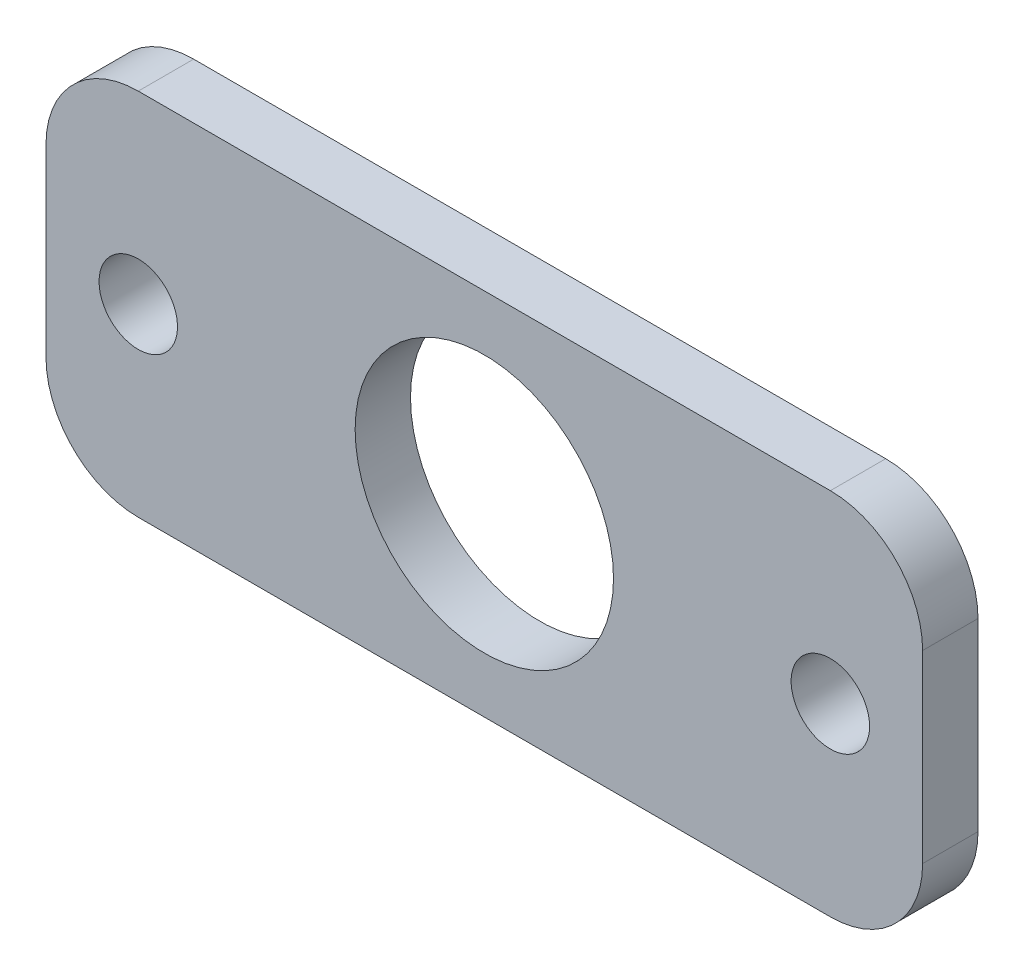
ISO-10303-21;
HEADER;
FILE_DESCRIPTION(('STEP AP214'),'2;1');
FILE_NAME('part.step','',(''),(''),'','','');
FILE_SCHEMA(('AUTOMOTIVE_DESIGN { 1 0 10303 214 1 1 1 1 }'));
ENDSEC;
DATA;
#1=APPLICATION_CONTEXT('core data for automotive mechanical design processes');
#2=APPLICATION_PROTOCOL_DEFINITION('international standard','automotive_design',2000,#1);
#3=PRODUCT_CONTEXT('',#1,'mechanical');
#4=PRODUCT('Part','Part','',(#3));
#5=PRODUCT_RELATED_PRODUCT_CATEGORY('part','',(#4));
#6=PRODUCT_DEFINITION_FORMATION('','',#4);
#7=PRODUCT_DEFINITION_CONTEXT('part definition',#1,'design');
#8=PRODUCT_DEFINITION('design','',#6,#7);
#9=PRODUCT_DEFINITION_SHAPE('','',#8);
#10=(LENGTH_UNIT() NAMED_UNIT(*) SI_UNIT(.MILLI.,.METRE.));
#11=(NAMED_UNIT(*) PLANE_ANGLE_UNIT() SI_UNIT($,.RADIAN.));
#12=(NAMED_UNIT(*) SI_UNIT($,.STERADIAN.) SOLID_ANGLE_UNIT());
#13=UNCERTAINTY_MEASURE_WITH_UNIT(LENGTH_MEASURE(1.E-05),#10,'distance_accuracy_value','');
#14=(GEOMETRIC_REPRESENTATION_CONTEXT(3) GLOBAL_UNCERTAINTY_ASSIGNED_CONTEXT((#13)) GLOBAL_UNIT_ASSIGNED_CONTEXT((#10,
#11,#12)) REPRESENTATION_CONTEXT('',''));
#15=CARTESIAN_POINT('',(0.,0.,0.));
#16=DIRECTION('',(0.,0.,1.));
#17=DIRECTION('',(1.,0.,0.));
#18=AXIS2_PLACEMENT_3D('',#15,#16,#17);
#19=CARTESIAN_POINT('',(0.,0.,6.00000000000001));
#20=DIRECTION('',(0.,0.,-1.));
#21=DIRECTION('',(-1.,0.,0.));
#22=AXIS2_PLACEMENT_3D('',#19,#20,#21);
#23=PLANE('',#22);
#24=DIRECTION('',(0.,1.,0.));
#25=VECTOR('',#24,1.);
#26=CARTESIAN_POINT('',(395.,0.,6.00000000000001));
#27=LINE('',#26,#25);
#28=CARTESIAN_POINT('',(395.,-30.,6.00000000000001));
#29=VERTEX_POINT('',#28);
#30=CARTESIAN_POINT('',(395.,-10.,6.00000000000001));
#31=VERTEX_POINT('',#30);
#32=EDGE_CURVE('E153',#29,#31,#27,.T.);
#33=ORIENTED_EDGE('',*,*,#32,.T.);
#34=CARTESIAN_POINT('',(385.,-10.,6.00000000000001));
#35=DIRECTION('',(0.,0.,-1.));
#36=DIRECTION('',(-1.,0.,0.));
#37=AXIS2_PLACEMENT_3D('',#34,#35,#36);
#38=CIRCLE('',#37,10.);
#39=CARTESIAN_POINT('',(385.,0.,6.00000000000001));
#40=VERTEX_POINT('',#39);
#41=EDGE_CURVE('E177',#31,#40,#38,.F.);
#42=ORIENTED_EDGE('',*,*,#41,.T.);
#43=DIRECTION('',(-1.,0.,0.));
#44=VECTOR('',#43,1.);
#45=CARTESIAN_POINT('',(395.,0.,6.00000000000001));
#46=LINE('',#45,#44);
#47=CARTESIAN_POINT('',(310.,0.,6.00000000000001));
#48=VERTEX_POINT('',#47);
#49=EDGE_CURVE('E128',#40,#48,#46,.T.);
#50=ORIENTED_EDGE('',*,*,#49,.T.);
#51=CARTESIAN_POINT('',(310.,-10.,6.00000000000001));
#52=DIRECTION('',(0.,0.,-1.));
#53=DIRECTION('',(-1.,0.,0.));
#54=AXIS2_PLACEMENT_3D('',#51,#52,#53);
#55=CIRCLE('',#54,10.);
#56=CARTESIAN_POINT('',(300.,-10.,6.00000000000001));
#57=VERTEX_POINT('',#56);
#58=EDGE_CURVE('E169',#48,#57,#55,.F.);
#59=ORIENTED_EDGE('',*,*,#58,.T.);
#60=DIRECTION('',(0.,-1.,0.));
#61=VECTOR('',#60,1.);
#62=CARTESIAN_POINT('',(300.,0.,6.00000000000001));
#63=LINE('',#62,#61);
#64=CARTESIAN_POINT('',(300.,-30.,6.00000000000001));
#65=VERTEX_POINT('',#64);
#66=EDGE_CURVE('E193',#57,#65,#63,.T.);
#67=ORIENTED_EDGE('',*,*,#66,.T.);
#68=CARTESIAN_POINT('',(310.,-30.,6.00000000000001));
#69=DIRECTION('',(0.,0.,-1.));
#70=DIRECTION('',(-1.,0.,0.));
#71=AXIS2_PLACEMENT_3D('',#68,#69,#70);
#72=CIRCLE('',#71,10.);
#73=CARTESIAN_POINT('',(310.,-40.,6.00000000000001));
#74=VERTEX_POINT('',#73);
#75=EDGE_CURVE('E63',#65,#74,#72,.F.);
#76=ORIENTED_EDGE('',*,*,#75,.T.);
#77=DIRECTION('',(1.,0.,0.));
#78=VECTOR('',#77,1.);
#79=CARTESIAN_POINT('',(395.,-40.,6.00000000000001));
#80=LINE('',#79,#78);
#81=CARTESIAN_POINT('',(385.,-40.,6.00000000000001));
#82=VERTEX_POINT('',#81);
#83=EDGE_CURVE('E155',#74,#82,#80,.T.);
#84=ORIENTED_EDGE('',*,*,#83,.T.);
#85=CARTESIAN_POINT('',(385.,-30.,6.00000000000001));
#86=DIRECTION('',(0.,0.,-1.));
#87=DIRECTION('',(-1.,0.,0.));
#88=AXIS2_PLACEMENT_3D('',#85,#86,#87);
#89=CIRCLE('',#88,10.);
#90=EDGE_CURVE('E174',#82,#29,#89,.F.);
#91=ORIENTED_EDGE('',*,*,#90,.T.);
#92=EDGE_LOOP('',(#33,#42,#50,#59,#67,#76,#84,#91));
#93=FACE_BOUND('',#92,.T.);
#94=CARTESIAN_POINT('',(347.5,-20.,6.00000000000001));
#95=DIRECTION('',(0.,0.,1.));
#96=DIRECTION('',(1.,0.,0.));
#97=AXIS2_PLACEMENT_3D('',#94,#95,#96);
#98=CIRCLE('',#97,14.);
#99=CARTESIAN_POINT('',(361.5,-20.,6.00000000000001));
#100=VERTEX_POINT('',#99);
#101=EDGE_CURVE('E147',#100,#100,#98,.T.);
#102=ORIENTED_EDGE('',*,*,#101,.F.);
#103=EDGE_LOOP('',(#102));
#104=FACE_BOUND('',#103,.T.);
#105=CARTESIAN_POINT('',(385.,-20.,6.00000000000001));
#106=DIRECTION('',(0.,0.,1.));
#107=DIRECTION('',(1.,0.,0.));
#108=AXIS2_PLACEMENT_3D('',#105,#106,#107);
#109=CIRCLE('',#108,4.24999999999995);
#110=CARTESIAN_POINT('',(389.25,-20.,6.00000000000001));
#111=VERTEX_POINT('',#110);
#112=EDGE_CURVE('E213',#111,#111,#109,.T.);
#113=ORIENTED_EDGE('',*,*,#112,.F.);
#114=EDGE_LOOP('',(#113));
#115=FACE_BOUND('',#114,.T.);
#116=CARTESIAN_POINT('',(310.,-20.,6.00000000000001));
#117=DIRECTION('',(0.,0.,1.));
#118=DIRECTION('',(-1.,0.,0.));
#119=AXIS2_PLACEMENT_3D('',#116,#117,#118);
#120=CIRCLE('',#119,4.24999999999995);
#121=CARTESIAN_POINT('',(305.75,-20.,6.00000000000001));
#122=VERTEX_POINT('',#121);
#123=EDGE_CURVE('E221',#122,#122,#120,.T.);
#124=ORIENTED_EDGE('',*,*,#123,.F.);
#125=EDGE_LOOP('',(#124));
#126=FACE_BOUND('',#125,.T.);
#127=ADVANCED_FACE('F40',(#93,#104,#115,#126),#23,.F.);
#128=CARTESIAN_POINT('',(0.,0.,0.));
#129=DIRECTION('',(0.,0.,-1.));
#130=DIRECTION('',(-1.,0.,0.));
#131=AXIS2_PLACEMENT_3D('',#128,#129,#130);
#132=PLANE('',#131);
#133=CARTESIAN_POINT('',(385.,-20.,0.));
#134=DIRECTION('',(0.,0.,1.));
#135=DIRECTION('',(1.,0.,0.));
#136=AXIS2_PLACEMENT_3D('',#133,#134,#135);
#137=CIRCLE('',#136,4.24999999999995);
#138=CARTESIAN_POINT('',(389.25,-20.,0.));
#139=VERTEX_POINT('',#138);
#140=EDGE_CURVE('E217',#139,#139,#137,.T.);
#141=ORIENTED_EDGE('',*,*,#140,.T.);
#142=EDGE_LOOP('',(#141));
#143=FACE_BOUND('',#142,.T.);
#144=DIRECTION('',(-1.,0.,0.));
#145=VECTOR('',#144,1.);
#146=CARTESIAN_POINT('',(395.,0.,0.));
#147=LINE('',#146,#145);
#148=CARTESIAN_POINT('',(385.,0.,0.));
#149=VERTEX_POINT('',#148);
#150=CARTESIAN_POINT('',(310.,0.,0.));
#151=VERTEX_POINT('',#150);
#152=EDGE_CURVE('E125',#149,#151,#147,.T.);
#153=ORIENTED_EDGE('',*,*,#152,.F.);
#154=CARTESIAN_POINT('',(385.,-10.,0.));
#155=DIRECTION('',(0.,0.,-1.));
#156=DIRECTION('',(-1.,0.,0.));
#157=AXIS2_PLACEMENT_3D('',#154,#155,#156);
#158=CIRCLE('',#157,10.);
#159=CARTESIAN_POINT('',(395.,-10.,0.));
#160=VERTEX_POINT('',#159);
#161=EDGE_CURVE('E107',#149,#160,#158,.T.);
#162=ORIENTED_EDGE('',*,*,#161,.T.);
#163=DIRECTION('',(0.,1.,0.));
#164=VECTOR('',#163,1.);
#165=CARTESIAN_POINT('',(395.,0.,0.));
#166=LINE('',#165,#164);
#167=CARTESIAN_POINT('',(395.,-30.,0.));
#168=VERTEX_POINT('',#167);
#169=EDGE_CURVE('E138',#168,#160,#166,.T.);
#170=ORIENTED_EDGE('',*,*,#169,.F.);
#171=CARTESIAN_POINT('',(385.,-30.,0.));
#172=DIRECTION('',(0.,0.,-1.));
#173=DIRECTION('',(-1.,0.,0.));
#174=AXIS2_PLACEMENT_3D('',#171,#172,#173);
#175=CIRCLE('',#174,10.);
#176=CARTESIAN_POINT('',(385.,-40.,0.));
#177=VERTEX_POINT('',#176);
#178=EDGE_CURVE('E119',#168,#177,#175,.T.);
#179=ORIENTED_EDGE('',*,*,#178,.T.);
#180=DIRECTION('',(1.,0.,0.));
#181=VECTOR('',#180,1.);
#182=CARTESIAN_POINT('',(395.,-40.,0.));
#183=LINE('',#182,#181);
#184=CARTESIAN_POINT('',(310.,-40.,0.));
#185=VERTEX_POINT('',#184);
#186=EDGE_CURVE('E144',#185,#177,#183,.T.);
#187=ORIENTED_EDGE('',*,*,#186,.F.);
#188=CARTESIAN_POINT('',(310.,-30.,0.));
#189=DIRECTION('',(0.,0.,-1.));
#190=DIRECTION('',(-1.,0.,0.));
#191=AXIS2_PLACEMENT_3D('',#188,#189,#190);
#192=CIRCLE('',#191,10.);
#193=CARTESIAN_POINT('',(300.,-30.,0.));
#194=VERTEX_POINT('',#193);
#195=EDGE_CURVE('E159',#185,#194,#192,.T.);
#196=ORIENTED_EDGE('',*,*,#195,.T.);
#197=DIRECTION('',(0.,-1.,0.));
#198=VECTOR('',#197,1.);
#199=CARTESIAN_POINT('',(300.,0.,0.));
#200=LINE('',#199,#198);
#201=CARTESIAN_POINT('',(300.,-10.,0.));
#202=VERTEX_POINT('',#201);
#203=EDGE_CURVE('E137',#202,#194,#200,.T.);
#204=ORIENTED_EDGE('',*,*,#203,.F.);
#205=CARTESIAN_POINT('',(310.,-10.,0.));
#206=DIRECTION('',(0.,0.,-1.));
#207=DIRECTION('',(-1.,0.,0.));
#208=AXIS2_PLACEMENT_3D('',#205,#206,#207);
#209=CIRCLE('',#208,10.);
#210=EDGE_CURVE('E130',#202,#151,#209,.T.);
#211=ORIENTED_EDGE('',*,*,#210,.T.);
#212=EDGE_LOOP('',(#153,#162,#170,#179,#187,#196,#204,#211));
#213=FACE_BOUND('',#212,.T.);
#214=CARTESIAN_POINT('',(347.5,-20.,0.));
#215=DIRECTION('',(0.,0.,1.));
#216=DIRECTION('',(1.,0.,0.));
#217=AXIS2_PLACEMENT_3D('',#214,#215,#216);
#218=CIRCLE('',#217,14.);
#219=CARTESIAN_POINT('',(361.5,-20.,0.));
#220=VERTEX_POINT('',#219);
#221=EDGE_CURVE('E210',#220,#220,#218,.T.);
#222=ORIENTED_EDGE('',*,*,#221,.T.);
#223=EDGE_LOOP('',(#222));
#224=FACE_BOUND('',#223,.T.);
#225=CARTESIAN_POINT('',(310.,-20.,0.));
#226=DIRECTION('',(0.,0.,1.));
#227=DIRECTION('',(-1.,0.,0.));
#228=AXIS2_PLACEMENT_3D('',#225,#226,#227);
#229=CIRCLE('',#228,4.24999999999995);
#230=CARTESIAN_POINT('',(305.75,-20.,0.));
#231=VERTEX_POINT('',#230);
#232=EDGE_CURVE('E225',#231,#231,#229,.T.);
#233=ORIENTED_EDGE('',*,*,#232,.T.);
#234=EDGE_LOOP('',(#233));
#235=FACE_BOUND('',#234,.T.);
#236=ADVANCED_FACE('F133',(#143,#213,#224,#235),#132,.T.);
#237=CARTESIAN_POINT('',(395.,0.,6.00000000000001));
#238=DIRECTION('',(-1.,0.,0.));
#239=DIRECTION('',(0.,0.,1.));
#240=AXIS2_PLACEMENT_3D('',#237,#238,#239);
#241=PLANE('',#240);
#242=ORIENTED_EDGE('',*,*,#169,.T.);
#243=DIRECTION('',(0.,0.,-1.));
#244=VECTOR('',#243,1.);
#245=CARTESIAN_POINT('',(395.,-10.,6.00000000000001));
#246=LINE('',#245,#244);
#247=EDGE_CURVE('E112',#160,#31,#246,.F.);
#248=ORIENTED_EDGE('',*,*,#247,.T.);
#249=ORIENTED_EDGE('',*,*,#32,.F.);
#250=DIRECTION('',(0.,0.,-1.));
#251=VECTOR('',#250,1.);
#252=CARTESIAN_POINT('',(395.,-30.,6.00000000000001));
#253=LINE('',#252,#251);
#254=EDGE_CURVE('E118',#29,#168,#253,.T.);
#255=ORIENTED_EDGE('',*,*,#254,.T.);
#256=EDGE_LOOP('',(#242,#248,#249,#255));
#257=FACE_BOUND('',#256,.T.);
#258=ADVANCED_FACE('F240',(#257),#241,.F.);
#259=CARTESIAN_POINT('',(395.,0.,6.00000000000001));
#260=DIRECTION('',(0.,-1.,0.));
#261=DIRECTION('',(1.,0.,0.));
#262=AXIS2_PLACEMENT_3D('',#259,#260,#261);
#263=PLANE('',#262);
#264=ORIENTED_EDGE('',*,*,#49,.F.);
#265=DIRECTION('',(0.,0.,-1.));
#266=VECTOR('',#265,1.);
#267=CARTESIAN_POINT('',(385.,0.,6.00000000000001));
#268=LINE('',#267,#266);
#269=EDGE_CURVE('E111',#40,#149,#268,.T.);
#270=ORIENTED_EDGE('',*,*,#269,.T.);
#271=ORIENTED_EDGE('',*,*,#152,.T.);
#272=DIRECTION('',(0.,0.,-1.));
#273=VECTOR('',#272,1.);
#274=CARTESIAN_POINT('',(310.,0.,6.00000000000001));
#275=LINE('',#274,#273);
#276=EDGE_CURVE('E131',#151,#48,#275,.F.);
#277=ORIENTED_EDGE('',*,*,#276,.T.);
#278=EDGE_LOOP('',(#264,#270,#271,#277));
#279=FACE_BOUND('',#278,.T.);
#280=ADVANCED_FACE('F124',(#279),#263,.F.);
#281=CARTESIAN_POINT('',(300.,0.,6.00000000000001));
#282=DIRECTION('',(1.,0.,0.));
#283=DIRECTION('',(0.,0.,-1.));
#284=AXIS2_PLACEMENT_3D('',#281,#282,#283);
#285=PLANE('',#284);
#286=ORIENTED_EDGE('',*,*,#203,.T.);
#287=DIRECTION('',(0.,0.,-1.));
#288=VECTOR('',#287,1.);
#289=CARTESIAN_POINT('',(300.,-30.,6.00000000000001));
#290=LINE('',#289,#288);
#291=EDGE_CURVE('E11',#194,#65,#290,.F.);
#292=ORIENTED_EDGE('',*,*,#291,.T.);
#293=ORIENTED_EDGE('',*,*,#66,.F.);
#294=DIRECTION('',(0.,0.,-1.));
#295=VECTOR('',#294,1.);
#296=CARTESIAN_POINT('',(300.,-10.,6.00000000000001));
#297=LINE('',#296,#295);
#298=EDGE_CURVE('E49',#57,#202,#297,.T.);
#299=ORIENTED_EDGE('',*,*,#298,.T.);
#300=EDGE_LOOP('',(#286,#292,#293,#299));
#301=FACE_BOUND('',#300,.T.);
#302=ADVANCED_FACE('F191',(#301),#285,.F.);
#303=CARTESIAN_POINT('',(395.,-40.,6.00000000000001));
#304=DIRECTION('',(0.,1.,0.));
#305=DIRECTION('',(-1.,0.,0.));
#306=AXIS2_PLACEMENT_3D('',#303,#304,#305);
#307=PLANE('',#306);
#308=ORIENTED_EDGE('',*,*,#186,.T.);
#309=DIRECTION('',(0.,0.,-1.));
#310=VECTOR('',#309,1.);
#311=CARTESIAN_POINT('',(385.,-40.,6.00000000000001));
#312=LINE('',#311,#310);
#313=EDGE_CURVE('E56',#177,#82,#312,.F.);
#314=ORIENTED_EDGE('',*,*,#313,.T.);
#315=ORIENTED_EDGE('',*,*,#83,.F.);
#316=DIRECTION('',(0.,0.,-1.));
#317=VECTOR('',#316,1.);
#318=CARTESIAN_POINT('',(310.,-40.,6.00000000000001));
#319=LINE('',#318,#317);
#320=EDGE_CURVE('E180',#74,#185,#319,.T.);
#321=ORIENTED_EDGE('',*,*,#320,.T.);
#322=EDGE_LOOP('',(#308,#314,#315,#321));
#323=FACE_BOUND('',#322,.T.);
#324=ADVANCED_FACE('F200',(#323),#307,.F.);
#325=CARTESIAN_POINT('',(347.5,-20.,6.00000000000001));
#326=DIRECTION('',(0.,0.,-1.));
#327=DIRECTION('',(-1.,0.,0.));
#328=AXIS2_PLACEMENT_3D('',#325,#326,#327);
#329=CYLINDRICAL_SURFACE('',#328,14.);
#330=ORIENTED_EDGE('',*,*,#101,.T.);
#331=EDGE_LOOP('',(#330));
#332=FACE_BOUND('',#331,.T.);
#333=ORIENTED_EDGE('',*,*,#221,.F.);
#334=EDGE_LOOP('',(#333));
#335=FACE_BOUND('',#334,.T.);
#336=ADVANCED_FACE('F245',(#332,#335),#329,.F.);
#337=CARTESIAN_POINT('',(385.,-20.,6.00000000000001));
#338=DIRECTION('',(0.,0.,-1.));
#339=DIRECTION('',(-1.,0.,0.));
#340=AXIS2_PLACEMENT_3D('',#337,#338,#339);
#341=CYLINDRICAL_SURFACE('',#340,4.24999999999995);
#342=ORIENTED_EDGE('',*,*,#112,.T.);
#343=EDGE_LOOP('',(#342));
#344=FACE_BOUND('',#343,.T.);
#345=ORIENTED_EDGE('',*,*,#140,.F.);
#346=EDGE_LOOP('',(#345));
#347=FACE_BOUND('',#346,.T.);
#348=ADVANCED_FACE('F291',(#344,#347),#341,.F.);
#349=CARTESIAN_POINT('',(310.,-20.,6.00000000000001));
#350=DIRECTION('',(0.,0.,-1.));
#351=DIRECTION('',(-1.,0.,0.));
#352=AXIS2_PLACEMENT_3D('',#349,#350,#351);
#353=CYLINDRICAL_SURFACE('',#352,4.24999999999995);
#354=ORIENTED_EDGE('',*,*,#123,.T.);
#355=EDGE_LOOP('',(#354));
#356=FACE_BOUND('',#355,.T.);
#357=ORIENTED_EDGE('',*,*,#232,.F.);
#358=EDGE_LOOP('',(#357));
#359=FACE_BOUND('',#358,.T.);
#360=ADVANCED_FACE('F232',(#356,#359),#353,.F.);
#361=CARTESIAN_POINT('',(385.,-10.,6.00000000000001));
#362=DIRECTION('',(0.,0.,-1.));
#363=DIRECTION('',(-1.,0.,0.));
#364=AXIS2_PLACEMENT_3D('',#361,#362,#363);
#365=CYLINDRICAL_SURFACE('',#364,10.);
#366=ORIENTED_EDGE('',*,*,#41,.F.);
#367=ORIENTED_EDGE('',*,*,#247,.F.);
#368=ORIENTED_EDGE('',*,*,#161,.F.);
#369=ORIENTED_EDGE('',*,*,#269,.F.);
#370=EDGE_LOOP('',(#366,#367,#368,#369));
#371=FACE_BOUND('',#370,.T.);
#372=ADVANCED_FACE('F110',(#371),#365,.T.);
#373=CARTESIAN_POINT('',(385.,-30.,6.00000000000001));
#374=DIRECTION('',(0.,0.,-1.));
#375=DIRECTION('',(-1.,0.,0.));
#376=AXIS2_PLACEMENT_3D('',#373,#374,#375);
#377=CYLINDRICAL_SURFACE('',#376,10.);
#378=ORIENTED_EDGE('',*,*,#90,.F.);
#379=ORIENTED_EDGE('',*,*,#313,.F.);
#380=ORIENTED_EDGE('',*,*,#178,.F.);
#381=ORIENTED_EDGE('',*,*,#254,.F.);
#382=EDGE_LOOP('',(#378,#379,#380,#381));
#383=FACE_BOUND('',#382,.T.);
#384=ADVANCED_FACE('F259',(#383),#377,.T.);
#385=CARTESIAN_POINT('',(310.,-30.,6.00000000000001));
#386=DIRECTION('',(0.,0.,-1.));
#387=DIRECTION('',(-1.,0.,0.));
#388=AXIS2_PLACEMENT_3D('',#385,#386,#387);
#389=CYLINDRICAL_SURFACE('',#388,10.);
#390=ORIENTED_EDGE('',*,*,#75,.F.);
#391=ORIENTED_EDGE('',*,*,#291,.F.);
#392=ORIENTED_EDGE('',*,*,#195,.F.);
#393=ORIENTED_EDGE('',*,*,#320,.F.);
#394=EDGE_LOOP('',(#390,#391,#392,#393));
#395=FACE_BOUND('',#394,.T.);
#396=ADVANCED_FACE('F199',(#395),#389,.T.);
#397=CARTESIAN_POINT('',(310.,-10.,6.00000000000001));
#398=DIRECTION('',(0.,0.,-1.));
#399=DIRECTION('',(-1.,0.,0.));
#400=AXIS2_PLACEMENT_3D('',#397,#398,#399);
#401=CYLINDRICAL_SURFACE('',#400,10.);
#402=ORIENTED_EDGE('',*,*,#58,.F.);
#403=ORIENTED_EDGE('',*,*,#276,.F.);
#404=ORIENTED_EDGE('',*,*,#210,.F.);
#405=ORIENTED_EDGE('',*,*,#298,.F.);
#406=EDGE_LOOP('',(#402,#403,#404,#405));
#407=FACE_BOUND('',#406,.T.);
#408=ADVANCED_FACE('F42',(#407),#401,.T.);
#409=CLOSED_SHELL('',(#127,#236,#258,#280,#302,#324,#336,#348,#360,#372,#384,#396,#408));
#410=MANIFOLD_SOLID_BREP('B2',#409);
#411=ADVANCED_BREP_SHAPE_REPRESENTATION('',(#18,#410),#14);
#412=SHAPE_DEFINITION_REPRESENTATION(#9,#411);
ENDSEC;
END-ISO-10303-21;
